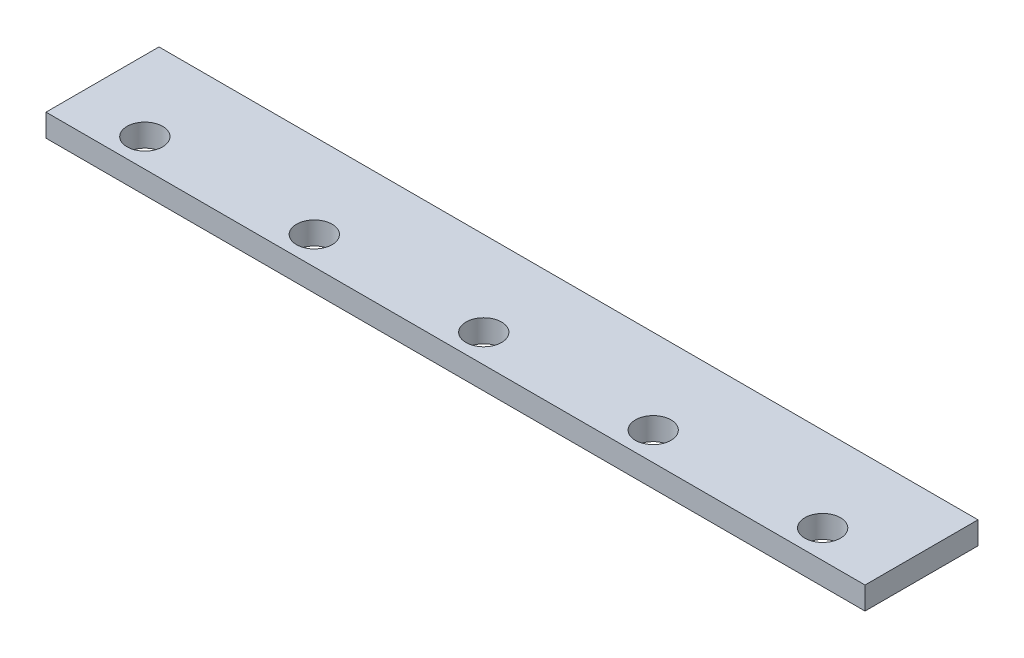
ISO-10303-21;
HEADER;
FILE_DESCRIPTION(('STEP AP214'),'2;1');
FILE_NAME('part.step','',(''),(''),'','','');
FILE_SCHEMA(('AUTOMOTIVE_DESIGN { 1 0 10303 214 1 1 1 1 }'));
ENDSEC;
DATA;
#1=APPLICATION_CONTEXT('core data for automotive mechanical design processes');
#2=APPLICATION_PROTOCOL_DEFINITION('international standard','automotive_design',2000,#1);
#3=PRODUCT_CONTEXT('',#1,'mechanical');
#4=PRODUCT('Part','Part','',(#3));
#5=PRODUCT_RELATED_PRODUCT_CATEGORY('part','',(#4));
#6=PRODUCT_DEFINITION_FORMATION('','',#4);
#7=PRODUCT_DEFINITION_CONTEXT('part definition',#1,'design');
#8=PRODUCT_DEFINITION('design','',#6,#7);
#9=PRODUCT_DEFINITION_SHAPE('','',#8);
#10=(LENGTH_UNIT() NAMED_UNIT(*) SI_UNIT(.MILLI.,.METRE.));
#11=(NAMED_UNIT(*) PLANE_ANGLE_UNIT() SI_UNIT($,.RADIAN.));
#12=(NAMED_UNIT(*) SI_UNIT($,.STERADIAN.) SOLID_ANGLE_UNIT());
#13=UNCERTAINTY_MEASURE_WITH_UNIT(LENGTH_MEASURE(1.E-05),#10,'distance_accuracy_value','');
#14=(GEOMETRIC_REPRESENTATION_CONTEXT(3) GLOBAL_UNCERTAINTY_ASSIGNED_CONTEXT((#13)) GLOBAL_UNIT_ASSIGNED_CONTEXT((#10,
#11,#12)) REPRESENTATION_CONTEXT('',''));
#15=CARTESIAN_POINT('',(0.,0.,0.));
#16=DIRECTION('',(0.,0.,1.));
#17=DIRECTION('',(1.,0.,0.));
#18=AXIS2_PLACEMENT_3D('',#15,#16,#17);
#19=CARTESIAN_POINT('',(530.,18.,60.));
#20=DIRECTION('',(0.,-1.,0.));
#21=DIRECTION('',(0.,0.,-1.));
#22=AXIS2_PLACEMENT_3D('',#19,#20,#21);
#23=CYLINDRICAL_SURFACE('',#22,12.6);
#24=CARTESIAN_POINT('',(530.,16.,60.));
#25=DIRECTION('',(0.,1.,0.));
#26=DIRECTION('',(0.,0.,1.));
#27=AXIS2_PLACEMENT_3D('',#24,#25,#26);
#28=CIRCLE('',#27,12.6);
#29=CARTESIAN_POINT('',(530.,16.,72.6));
#30=VERTEX_POINT('',#29);
#31=EDGE_CURVE('E41',#30,#30,#28,.F.);
#32=ORIENTED_EDGE('',*,*,#31,.F.);
#33=EDGE_LOOP('',(#32));
#34=FACE_BOUND('',#33,.T.);
#35=CARTESIAN_POINT('',(530.,0.,60.));
#36=DIRECTION('',(0.,1.,0.));
#37=DIRECTION('',(0.,0.,1.));
#38=AXIS2_PLACEMENT_3D('',#35,#36,#37);
#39=CIRCLE('',#38,12.6);
#40=CARTESIAN_POINT('',(530.,0.,72.6));
#41=VERTEX_POINT('',#40);
#42=EDGE_CURVE('E11',#41,#41,#39,.T.);
#43=ORIENTED_EDGE('',*,*,#42,.F.);
#44=EDGE_LOOP('',(#43));
#45=FACE_BOUND('',#44,.T.);
#46=ADVANCED_FACE('F33',(#34,#45),#23,.F.);
#47=CARTESIAN_POINT('',(410.,18.,60.));
#48=DIRECTION('',(0.,-1.,0.));
#49=DIRECTION('',(0.,0.,-1.));
#50=AXIS2_PLACEMENT_3D('',#47,#48,#49);
#51=CYLINDRICAL_SURFACE('',#50,12.6);
#52=CARTESIAN_POINT('',(410.,16.,60.));
#53=DIRECTION('',(0.,1.,0.));
#54=DIRECTION('',(0.,0.,1.));
#55=AXIS2_PLACEMENT_3D('',#52,#53,#54);
#56=CIRCLE('',#55,12.6);
#57=CARTESIAN_POINT('',(410.,16.,72.6));
#58=VERTEX_POINT('',#57);
#59=EDGE_CURVE('E123',#58,#58,#56,.F.);
#60=ORIENTED_EDGE('',*,*,#59,.F.);
#61=EDGE_LOOP('',(#60));
#62=FACE_BOUND('',#61,.T.);
#63=CARTESIAN_POINT('',(410.,0.,60.));
#64=DIRECTION('',(0.,1.,0.));
#65=DIRECTION('',(0.,0.,1.));
#66=AXIS2_PLACEMENT_3D('',#63,#64,#65);
#67=CIRCLE('',#66,12.6);
#68=CARTESIAN_POINT('',(410.,0.,72.6));
#69=VERTEX_POINT('',#68);
#70=EDGE_CURVE('E126',#69,#69,#67,.T.);
#71=ORIENTED_EDGE('',*,*,#70,.F.);
#72=EDGE_LOOP('',(#71));
#73=FACE_BOUND('',#72,.T.);
#74=ADVANCED_FACE('F135',(#62,#73),#51,.F.);
#75=CARTESIAN_POINT('',(290.,18.,60.));
#76=DIRECTION('',(0.,-1.,0.));
#77=DIRECTION('',(0.,0.,-1.));
#78=AXIS2_PLACEMENT_3D('',#75,#76,#77);
#79=CYLINDRICAL_SURFACE('',#78,12.6);
#80=CARTESIAN_POINT('',(290.,16.,60.));
#81=DIRECTION('',(0.,1.,0.));
#82=DIRECTION('',(0.,0.,1.));
#83=AXIS2_PLACEMENT_3D('',#80,#81,#82);
#84=CIRCLE('',#83,12.6);
#85=CARTESIAN_POINT('',(290.,16.,72.6));
#86=VERTEX_POINT('',#85);
#87=EDGE_CURVE('E117',#86,#86,#84,.F.);
#88=ORIENTED_EDGE('',*,*,#87,.F.);
#89=EDGE_LOOP('',(#88));
#90=FACE_BOUND('',#89,.T.);
#91=CARTESIAN_POINT('',(290.,0.,60.));
#92=DIRECTION('',(0.,1.,0.));
#93=DIRECTION('',(0.,0.,1.));
#94=AXIS2_PLACEMENT_3D('',#91,#92,#93);
#95=CIRCLE('',#94,12.6);
#96=CARTESIAN_POINT('',(290.,0.,72.6));
#97=VERTEX_POINT('',#96);
#98=EDGE_CURVE('E120',#97,#97,#95,.T.);
#99=ORIENTED_EDGE('',*,*,#98,.F.);
#100=EDGE_LOOP('',(#99));
#101=FACE_BOUND('',#100,.T.);
#102=ADVANCED_FACE('F181',(#90,#101),#79,.F.);
#103=CARTESIAN_POINT('',(170.,18.,60.));
#104=DIRECTION('',(0.,-1.,0.));
#105=DIRECTION('',(0.,0.,-1.));
#106=AXIS2_PLACEMENT_3D('',#103,#104,#105);
#107=CYLINDRICAL_SURFACE('',#106,12.6);
#108=CARTESIAN_POINT('',(170.,16.,60.));
#109=DIRECTION('',(0.,1.,0.));
#110=DIRECTION('',(0.,0.,1.));
#111=AXIS2_PLACEMENT_3D('',#108,#109,#110);
#112=CIRCLE('',#111,12.6);
#113=CARTESIAN_POINT('',(170.,16.,72.6));
#114=VERTEX_POINT('',#113);
#115=EDGE_CURVE('E111',#114,#114,#112,.F.);
#116=ORIENTED_EDGE('',*,*,#115,.F.);
#117=EDGE_LOOP('',(#116));
#118=FACE_BOUND('',#117,.T.);
#119=CARTESIAN_POINT('',(170.,0.,60.));
#120=DIRECTION('',(0.,1.,0.));
#121=DIRECTION('',(0.,0.,1.));
#122=AXIS2_PLACEMENT_3D('',#119,#120,#121);
#123=CIRCLE('',#122,12.6);
#124=CARTESIAN_POINT('',(170.,0.,72.6));
#125=VERTEX_POINT('',#124);
#126=EDGE_CURVE('E114',#125,#125,#123,.T.);
#127=ORIENTED_EDGE('',*,*,#126,.F.);
#128=EDGE_LOOP('',(#127));
#129=FACE_BOUND('',#128,.T.);
#130=ADVANCED_FACE('F170',(#118,#129),#107,.F.);
#131=CARTESIAN_POINT('',(0.,16.,0.));
#132=DIRECTION('',(0.,1.,0.));
#133=DIRECTION('',(0.,0.,1.));
#134=AXIS2_PLACEMENT_3D('',#131,#132,#133);
#135=PLANE('',#134);
#136=ORIENTED_EDGE('',*,*,#31,.T.);
#137=EDGE_LOOP('',(#136));
#138=FACE_BOUND('',#137,.T.);
#139=ORIENTED_EDGE('',*,*,#59,.T.);
#140=EDGE_LOOP('',(#139));
#141=FACE_BOUND('',#140,.T.);
#142=ORIENTED_EDGE('',*,*,#87,.T.);
#143=EDGE_LOOP('',(#142));
#144=FACE_BOUND('',#143,.T.);
#145=ORIENTED_EDGE('',*,*,#115,.T.);
#146=EDGE_LOOP('',(#145));
#147=FACE_BOUND('',#146,.T.);
#148=DIRECTION('',(0.,0.,1.));
#149=VECTOR('',#148,1.);
#150=CARTESIAN_POINT('',(0.,16.,0.));
#151=LINE('',#150,#149);
#152=CARTESIAN_POINT('',(0.,16.,0.));
#153=VERTEX_POINT('',#152);
#154=CARTESIAN_POINT('',(0.,16.,80.));
#155=VERTEX_POINT('',#154);
#156=EDGE_CURVE('E86',#153,#155,#151,.T.);
#157=ORIENTED_EDGE('',*,*,#156,.T.);
#158=DIRECTION('',(1.,0.,0.));
#159=VECTOR('',#158,1.);
#160=CARTESIAN_POINT('',(0.,16.,80.));
#161=LINE('',#160,#159);
#162=CARTESIAN_POINT('',(580.,16.,80.));
#163=VERTEX_POINT('',#162);
#164=EDGE_CURVE('E80',#155,#163,#161,.T.);
#165=ORIENTED_EDGE('',*,*,#164,.T.);
#166=DIRECTION('',(0.,0.,-1.));
#167=VECTOR('',#166,1.);
#168=CARTESIAN_POINT('',(580.,16.,0.));
#169=LINE('',#168,#167);
#170=CARTESIAN_POINT('',(580.,16.,0.));
#171=VERTEX_POINT('',#170);
#172=EDGE_CURVE('E84',#163,#171,#169,.T.);
#173=ORIENTED_EDGE('',*,*,#172,.T.);
#174=DIRECTION('',(-1.,0.,0.));
#175=VECTOR('',#174,1.);
#176=CARTESIAN_POINT('',(0.,16.,0.));
#177=LINE('',#176,#175);
#178=EDGE_CURVE('E49',#171,#153,#177,.T.);
#179=ORIENTED_EDGE('',*,*,#178,.T.);
#180=EDGE_LOOP('',(#157,#165,#173,#179));
#181=FACE_BOUND('',#180,.T.);
#182=CARTESIAN_POINT('',(50.,16.,60.));
#183=DIRECTION('',(0.,1.,0.));
#184=DIRECTION('',(0.,0.,1.));
#185=AXIS2_PLACEMENT_3D('',#182,#183,#184);
#186=CIRCLE('',#185,12.6);
#187=CARTESIAN_POINT('',(50.,16.,72.6));
#188=VERTEX_POINT('',#187);
#189=EDGE_CURVE('E104',#188,#188,#186,.F.);
#190=ORIENTED_EDGE('',*,*,#189,.T.);
#191=EDGE_LOOP('',(#190));
#192=FACE_BOUND('',#191,.T.);
#193=ADVANCED_FACE('F81',(#138,#141,#144,#147,#181,#192),#135,.T.);
#194=CARTESIAN_POINT('',(0.,0.,0.));
#195=DIRECTION('',(0.,1.,0.));
#196=DIRECTION('',(0.,0.,1.));
#197=AXIS2_PLACEMENT_3D('',#194,#195,#196);
#198=PLANE('',#197);
#199=ORIENTED_EDGE('',*,*,#42,.T.);
#200=EDGE_LOOP('',(#199));
#201=FACE_BOUND('',#200,.T.);
#202=ORIENTED_EDGE('',*,*,#70,.T.);
#203=EDGE_LOOP('',(#202));
#204=FACE_BOUND('',#203,.T.);
#205=ORIENTED_EDGE('',*,*,#98,.T.);
#206=EDGE_LOOP('',(#205));
#207=FACE_BOUND('',#206,.T.);
#208=ORIENTED_EDGE('',*,*,#126,.T.);
#209=EDGE_LOOP('',(#208));
#210=FACE_BOUND('',#209,.T.);
#211=DIRECTION('',(0.,0.,1.));
#212=VECTOR('',#211,1.);
#213=CARTESIAN_POINT('',(0.,0.,0.));
#214=LINE('',#213,#212);
#215=CARTESIAN_POINT('',(0.,0.,0.));
#216=VERTEX_POINT('',#215);
#217=CARTESIAN_POINT('',(0.,0.,80.));
#218=VERTEX_POINT('',#217);
#219=EDGE_CURVE('E101',#216,#218,#214,.T.);
#220=ORIENTED_EDGE('',*,*,#219,.F.);
#221=DIRECTION('',(-1.,0.,0.));
#222=VECTOR('',#221,1.);
#223=CARTESIAN_POINT('',(0.,0.,0.));
#224=LINE('',#223,#222);
#225=CARTESIAN_POINT('',(580.,0.,0.));
#226=VERTEX_POINT('',#225);
#227=EDGE_CURVE('E72',#226,#216,#224,.T.);
#228=ORIENTED_EDGE('',*,*,#227,.F.);
#229=DIRECTION('',(0.,0.,-1.));
#230=VECTOR('',#229,1.);
#231=CARTESIAN_POINT('',(580.,0.,0.));
#232=LINE('',#231,#230);
#233=CARTESIAN_POINT('',(580.,0.,80.));
#234=VERTEX_POINT('',#233);
#235=EDGE_CURVE('E66',#234,#226,#232,.T.);
#236=ORIENTED_EDGE('',*,*,#235,.F.);
#237=DIRECTION('',(1.,0.,0.));
#238=VECTOR('',#237,1.);
#239=CARTESIAN_POINT('',(0.,0.,80.));
#240=LINE('',#239,#238);
#241=EDGE_CURVE('E91',#218,#234,#240,.T.);
#242=ORIENTED_EDGE('',*,*,#241,.F.);
#243=EDGE_LOOP('',(#220,#228,#236,#242));
#244=FACE_BOUND('',#243,.T.);
#245=CARTESIAN_POINT('',(50.,0.,60.));
#246=DIRECTION('',(0.,1.,0.));
#247=DIRECTION('',(0.,0.,1.));
#248=AXIS2_PLACEMENT_3D('',#245,#246,#247);
#249=CIRCLE('',#248,12.6);
#250=CARTESIAN_POINT('',(50.,0.,72.6));
#251=VERTEX_POINT('',#250);
#252=EDGE_CURVE('E153',#251,#251,#249,.T.);
#253=ORIENTED_EDGE('',*,*,#252,.T.);
#254=EDGE_LOOP('',(#253));
#255=FACE_BOUND('',#254,.T.);
#256=ADVANCED_FACE('F138',(#201,#204,#207,#210,#244,#255),#198,.F.);
#257=CARTESIAN_POINT('',(0.,16.,0.));
#258=DIRECTION('',(1.,0.,0.));
#259=DIRECTION('',(0.,0.,-1.));
#260=AXIS2_PLACEMENT_3D('',#257,#258,#259);
#261=PLANE('',#260);
#262=ORIENTED_EDGE('',*,*,#219,.T.);
#263=DIRECTION('',(0.,-1.,0.));
#264=VECTOR('',#263,1.);
#265=CARTESIAN_POINT('',(0.,16.,80.));
#266=LINE('',#265,#264);
#267=EDGE_CURVE('E92',#155,#218,#266,.T.);
#268=ORIENTED_EDGE('',*,*,#267,.F.);
#269=ORIENTED_EDGE('',*,*,#156,.F.);
#270=DIRECTION('',(0.,-1.,0.));
#271=VECTOR('',#270,1.);
#272=CARTESIAN_POINT('',(0.,16.,0.));
#273=LINE('',#272,#271);
#274=EDGE_CURVE('E97',#153,#216,#273,.T.);
#275=ORIENTED_EDGE('',*,*,#274,.T.);
#276=EDGE_LOOP('',(#262,#268,#269,#275));
#277=FACE_BOUND('',#276,.T.);
#278=ADVANCED_FACE('F141',(#277),#261,.F.);
#279=CARTESIAN_POINT('',(0.,16.,80.));
#280=DIRECTION('',(0.,0.,-1.));
#281=DIRECTION('',(-1.,0.,0.));
#282=AXIS2_PLACEMENT_3D('',#279,#280,#281);
#283=PLANE('',#282);
#284=ORIENTED_EDGE('',*,*,#241,.T.);
#285=DIRECTION('',(0.,-1.,0.));
#286=VECTOR('',#285,1.);
#287=CARTESIAN_POINT('',(580.,16.,80.));
#288=LINE('',#287,#286);
#289=EDGE_CURVE('E89',#163,#234,#288,.T.);
#290=ORIENTED_EDGE('',*,*,#289,.F.);
#291=ORIENTED_EDGE('',*,*,#164,.F.);
#292=ORIENTED_EDGE('',*,*,#267,.T.);
#293=EDGE_LOOP('',(#284,#290,#291,#292));
#294=FACE_BOUND('',#293,.T.);
#295=ADVANCED_FACE('F90',(#294),#283,.F.);
#296=CARTESIAN_POINT('',(580.,16.,0.));
#297=DIRECTION('',(-1.,0.,0.));
#298=DIRECTION('',(0.,0.,1.));
#299=AXIS2_PLACEMENT_3D('',#296,#297,#298);
#300=PLANE('',#299);
#301=ORIENTED_EDGE('',*,*,#235,.T.);
#302=DIRECTION('',(0.,-1.,0.));
#303=VECTOR('',#302,1.);
#304=CARTESIAN_POINT('',(580.,16.,0.));
#305=LINE('',#304,#303);
#306=EDGE_CURVE('E93',#171,#226,#305,.T.);
#307=ORIENTED_EDGE('',*,*,#306,.F.);
#308=ORIENTED_EDGE('',*,*,#172,.F.);
#309=ORIENTED_EDGE('',*,*,#289,.T.);
#310=EDGE_LOOP('',(#301,#307,#308,#309));
#311=FACE_BOUND('',#310,.T.);
#312=ADVANCED_FACE('F95',(#311),#300,.F.);
#313=CARTESIAN_POINT('',(0.,16.,0.));
#314=DIRECTION('',(0.,0.,1.));
#315=DIRECTION('',(1.,0.,0.));
#316=AXIS2_PLACEMENT_3D('',#313,#314,#315);
#317=PLANE('',#316);
#318=ORIENTED_EDGE('',*,*,#227,.T.);
#319=ORIENTED_EDGE('',*,*,#274,.F.);
#320=ORIENTED_EDGE('',*,*,#178,.F.);
#321=ORIENTED_EDGE('',*,*,#306,.T.);
#322=EDGE_LOOP('',(#318,#319,#320,#321));
#323=FACE_BOUND('',#322,.T.);
#324=ADVANCED_FACE('F162',(#323),#317,.F.);
#325=CARTESIAN_POINT('',(50.,18.,60.));
#326=DIRECTION('',(0.,-1.,0.));
#327=DIRECTION('',(0.,0.,-1.));
#328=AXIS2_PLACEMENT_3D('',#325,#326,#327);
#329=CYLINDRICAL_SURFACE('',#328,12.6);
#330=ORIENTED_EDGE('',*,*,#189,.F.);
#331=EDGE_LOOP('',(#330));
#332=FACE_BOUND('',#331,.T.);
#333=ORIENTED_EDGE('',*,*,#252,.F.);
#334=EDGE_LOOP('',(#333));
#335=FACE_BOUND('',#334,.T.);
#336=ADVANCED_FACE('F160',(#332,#335),#329,.F.);
#337=CLOSED_SHELL('',(#46,#74,#102,#130,#193,#256,#278,#295,#312,#324,#336));
#338=MANIFOLD_SOLID_BREP('B2',#337);
#339=ADVANCED_BREP_SHAPE_REPRESENTATION('',(#18,#338),#14);
#340=SHAPE_DEFINITION_REPRESENTATION(#9,#339);
ENDSEC;
END-ISO-10303-21;
